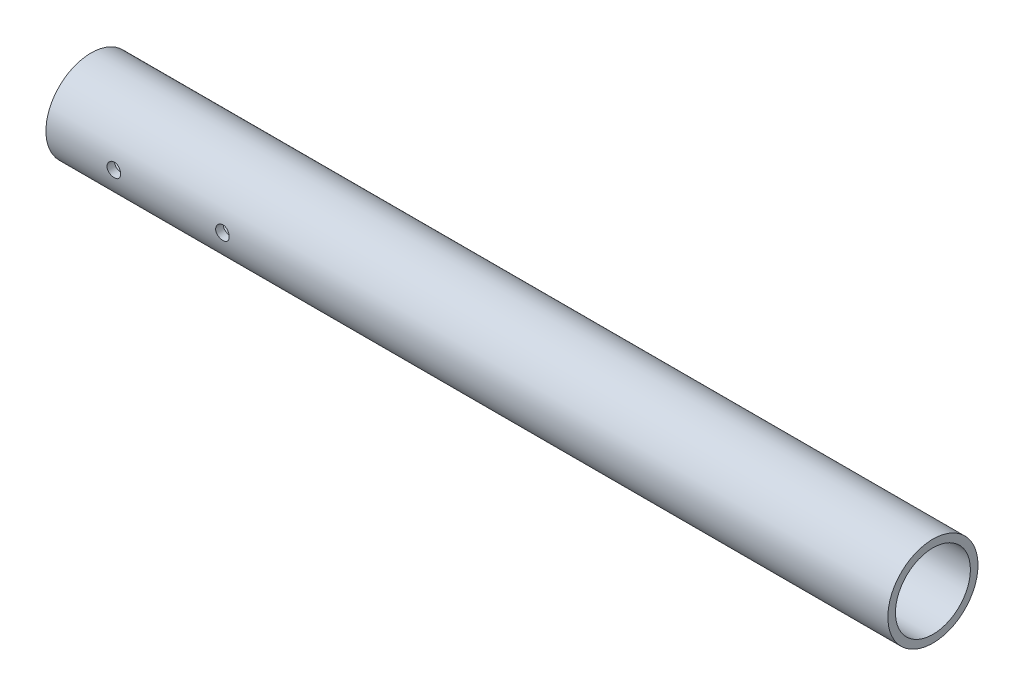
ISO-10303-21;
HEADER;
FILE_DESCRIPTION(('STEP AP214'),'2;1');
FILE_NAME('part.step','',(''),(''),'','','');
FILE_SCHEMA(('AUTOMOTIVE_DESIGN { 1 0 10303 214 1 1 1 1 }'));
ENDSEC;
DATA;
#1=APPLICATION_CONTEXT('core data for automotive mechanical design processes');
#2=APPLICATION_PROTOCOL_DEFINITION('international standard','automotive_design',2000,#1);
#3=PRODUCT_CONTEXT('',#1,'mechanical');
#4=PRODUCT('Part','Part','',(#3));
#5=PRODUCT_RELATED_PRODUCT_CATEGORY('part','',(#4));
#6=PRODUCT_DEFINITION_FORMATION('','',#4);
#7=PRODUCT_DEFINITION_CONTEXT('part definition',#1,'design');
#8=PRODUCT_DEFINITION('design','',#6,#7);
#9=PRODUCT_DEFINITION_SHAPE('','',#8);
#10=(LENGTH_UNIT() NAMED_UNIT(*) SI_UNIT(.MILLI.,.METRE.));
#11=(NAMED_UNIT(*) PLANE_ANGLE_UNIT() SI_UNIT($,.RADIAN.));
#12=(NAMED_UNIT(*) SI_UNIT($,.STERADIAN.) SOLID_ANGLE_UNIT());
#13=UNCERTAINTY_MEASURE_WITH_UNIT(LENGTH_MEASURE(1.E-05),#10,'distance_accuracy_value','');
#14=(GEOMETRIC_REPRESENTATION_CONTEXT(3) GLOBAL_UNCERTAINTY_ASSIGNED_CONTEXT((#13)) GLOBAL_UNIT_ASSIGNED_CONTEXT((#10,
#11,#12)) REPRESENTATION_CONTEXT('',''));
#15=CARTESIAN_POINT('',(0.,0.,0.));
#16=DIRECTION('',(0.,0.,1.));
#17=DIRECTION('',(1.,0.,0.));
#18=AXIS2_PLACEMENT_3D('',#15,#16,#17);
#19=CARTESIAN_POINT('',(-196.85,0.,0.));
#20=DIRECTION('',(1.,0.,0.));
#21=DIRECTION('',(0.,0.,-1.));
#22=AXIS2_PLACEMENT_3D('',#19,#20,#21);
#23=CYLINDRICAL_SURFACE('',#22,21.082);
#24=CARTESIAN_POINT('',(-196.85,0.,0.));
#25=DIRECTION('',(1.,0.,0.));
#26=DIRECTION('',(0.,0.,-1.));
#27=AXIS2_PLACEMENT_3D('',#24,#25,#26);
#28=CIRCLE('',#27,21.082);
#29=CARTESIAN_POINT('',(-196.85,0.,-21.082));
#30=VERTEX_POINT('',#29);
#31=EDGE_CURVE('E10',#30,#30,#28,.T.);
#32=ORIENTED_EDGE('',*,*,#31,.T.);
#33=EDGE_LOOP('',(#32));
#34=FACE_BOUND('',#33,.T.);
#35=CARTESIAN_POINT('',(196.85,0.,0.));
#36=DIRECTION('',(1.,0.,0.));
#37=DIRECTION('',(0.,0.,-1.));
#38=AXIS2_PLACEMENT_3D('',#35,#36,#37);
#39=CIRCLE('',#38,21.082);
#40=CARTESIAN_POINT('',(196.85,0.,-21.082));
#41=VERTEX_POINT('',#40);
#42=EDGE_CURVE('E49',#41,#41,#39,.T.);
#43=ORIENTED_EDGE('',*,*,#42,.F.);
#44=EDGE_LOOP('',(#43));
#45=FACE_BOUND('',#44,.T.);
#46=CARTESIAN_POINT('',(-168.275,0.,21.082));
#47=CARTESIAN_POINT('',(-168.274992696243,0.177265588906064,21.0819971511082));
#48=CARTESIAN_POINT('',(-168.260104327722,0.354633825443566,21.0797407978607));
#49=CARTESIAN_POINT('',(-168.200959639785,0.704412011201187,21.0709569196678));
#50=CARTESIAN_POINT('',(-168.156674780004,0.876816971803984,21.064425243998));
#51=CARTESIAN_POINT('',(-168.040090861165,1.2115560497482,21.0478246855302));
#52=CARTESIAN_POINT('',(-167.967813035828,1.37389769247854,21.0377584843423));
#53=CARTESIAN_POINT('',(-167.797346902468,1.68412370373541,21.0152009969064));
#54=CARTESIAN_POINT('',(-167.69916217104,1.8320100640365,21.0027100454717));
#55=CARTESIAN_POINT('',(-167.478845794194,2.11031643435081,20.9765819826565));
#56=CARTESIAN_POINT('',(-167.3565504399,2.24060616148059,20.9629374218632));
#57=CARTESIAN_POINT('',(-167.091836613573,2.47889671955909,20.9360982303561));
#58=CARTESIAN_POINT('',(-166.949416981135,2.58689626432784,20.9229036256421));
#59=CARTESIAN_POINT('',(-166.647621345587,2.77804840978029,20.8983859912104));
#60=CARTESIAN_POINT('',(-166.488164593206,2.86107486347093,20.8870725883659));
#61=CARTESIAN_POINT('',(-166.157370426842,2.99911783525678,20.8677000439257));
#62=CARTESIAN_POINT('',(-165.986033666236,3.05413589237425,20.8596407235276));
#63=CARTESIAN_POINT('',(-165.637713637157,3.13419550245969,20.8477621012251));
#64=CARTESIAN_POINT('',(-165.460782744137,3.15946016290709,20.8439112577396));
#65=CARTESIAN_POINT('',(-165.105154056933,3.17998699422211,20.8407898425614));
#66=CARTESIAN_POINT('',(-164.926456365603,3.17525090142445,20.8415190057945));
#67=CARTESIAN_POINT('',(-164.573943290049,3.13609297404926,20.8474463775802));
#68=CARTESIAN_POINT('',(-164.40009957517,3.101919701057,20.852607165254));
#69=CARTESIAN_POINT('',(-164.060642024393,3.00524659900985,20.8667578327125));
#70=CARTESIAN_POINT('',(-163.895028423173,2.9427459627244,20.8757478216156));
#71=CARTESIAN_POINT('',(-163.57597641876,2.79093400118089,20.8965852461813));
#72=CARTESIAN_POINT('',(-163.422588837981,2.70151746318002,20.9084438587404));
#73=CARTESIAN_POINT('',(-163.132900855916,2.49848682809598,20.9336742925736));
#74=CARTESIAN_POINT('',(-162.996601585936,2.38487113028626,20.9470462139227));
#75=CARTESIAN_POINT('',(-162.743518756676,2.13530326568608,20.9739618878807));
#76=CARTESIAN_POINT('',(-162.626945855511,1.99913740955179,20.9875060134767));
#77=CARTESIAN_POINT('',(-162.418274544488,1.70906259522473,21.0131148002247));
#78=CARTESIAN_POINT('',(-162.326176243369,1.55515355820367,21.0251794548033));
#79=CARTESIAN_POINT('',(-162.169057340399,1.23377816277263,21.0464826923882));
#80=CARTESIAN_POINT('',(-162.104053073529,1.0663036982249,21.0557195696406));
#81=CARTESIAN_POINT('',(-162.003151041654,0.722645240857121,21.070312259879));
#82=CARTESIAN_POINT('',(-161.967251292923,0.546461842495148,21.0756683373726));
#83=CARTESIAN_POINT('',(-161.925857666781,0.192204765370476,21.0818608911754));
#84=CARTESIAN_POINT('',(-161.920074191204,0.014165649847102,21.0827404122035));
#85=CARTESIAN_POINT('',(-161.938308481612,-0.340339952440584,21.0799979514801));
#86=CARTESIAN_POINT('',(-161.962325317379,-0.516806488119846,21.0763761102388));
#87=CARTESIAN_POINT('',(-162.039237666121,-0.862279899383923,21.0650645063623));
#88=CARTESIAN_POINT('',(-162.091992010307,-1.03131891039135,21.0573946347692));
#89=CARTESIAN_POINT('',(-162.224732948251,-1.35815274399451,21.0388441665934));
#90=CARTESIAN_POINT('',(-162.304720829788,-1.51594703443955,21.0279634181826));
#91=CARTESIAN_POINT('',(-162.490337139215,-1.81708511576191,21.0040933283749));
#92=CARTESIAN_POINT('',(-162.596149173084,-1.9603145348408,20.9910891189132));
#93=CARTESIAN_POINT('',(-162.830154648818,-2.22708618632573,20.9644655933992));
#94=CARTESIAN_POINT('',(-162.958349402479,-2.35062726403488,20.9508462413297));
#95=CARTESIAN_POINT('',(-163.234770906888,-2.57556977848286,20.9243908347895));
#96=CARTESIAN_POINT('',(-163.383156506261,-2.67677703259561,20.9115622997957));
#97=CARTESIAN_POINT('',(-163.694991994603,-2.8528290309045,20.888274456038));
#98=CARTESIAN_POINT('',(-163.858441473836,-2.92767449187153,20.8778150828597));
#99=CARTESIAN_POINT('',(-164.195187201683,-3.04857772519442,20.8605043047131));
#100=CARTESIAN_POINT('',(-164.368446144862,-3.09473749350594,20.8536401303661));
#101=CARTESIAN_POINT('',(-164.720368391081,-3.15728352894343,20.8442630448294));
#102=CARTESIAN_POINT('',(-164.899031316753,-3.17367187018762,20.8417498305174));
#103=CARTESIAN_POINT('',(-165.25475433616,-3.17616021106899,20.8413705974415));
#104=CARTESIAN_POINT('',(-165.431812319645,-3.16256554437416,20.8434577306442));
#105=CARTESIAN_POINT('',(-165.781093207795,-3.10612829026899,20.8519421795031));
#106=CARTESIAN_POINT('',(-165.95331612046,-3.0632857512491,20.8583394880282));
#107=CARTESIAN_POINT('',(-166.287952316415,-2.94967717748468,20.874707044174));
#108=CARTESIAN_POINT('',(-166.450373046203,-2.87893265513936,20.8846745386426));
#109=CARTESIAN_POINT('',(-166.761089428502,-2.71155871536681,20.9070627102117));
#110=CARTESIAN_POINT('',(-166.909384594736,-2.61492840724793,20.9194834717215));
#111=CARTESIAN_POINT('',(-167.189191280687,-2.39741725845486,20.9455292166376));
#112=CARTESIAN_POINT('',(-167.320526091709,-2.27631033164998,20.9591647100844));
#113=CARTESIAN_POINT('',(-167.561117181648,-2.01376149306829,20.9860159394496));
#114=CARTESIAN_POINT('',(-167.670368323069,-1.87231486257536,20.9992315770924));
#115=CARTESIAN_POINT('',(-167.864233030242,-1.57217776718591,21.0238378848768));
#116=CARTESIAN_POINT('',(-167.948706474533,-1.41339594518085,21.0352180180234));
#117=CARTESIAN_POINT('',(-168.089658721969,-1.08380087043068,21.0547677779054));
#118=CARTESIAN_POINT('',(-168.146166480664,-0.913000272113377,21.0629407235248));
#119=CARTESIAN_POINT('',(-168.216783136409,-0.617864332480806,21.0732924950954));
#120=CARTESIAN_POINT('',(-168.238581040015,-0.495349503289414,21.0765410154751));
#121=CARTESIAN_POINT('',(-168.267691941695,-0.248573261637352,21.0808957533839));
#122=CARTESIAN_POINT('',(-168.27500512194,-0.124311871162611,21.0820019978558));
#123=CARTESIAN_POINT('',(-168.275,0.,21.082));
#124=B_SPLINE_CURVE_WITH_KNOTS('',3,(#46,#47,#48,#49,#50,#51,#52,#53,#54,#55,#56,#57,#58,#59,
#60,#61,#62,#63,#64,#65,#66,#67,#68,#69,#70,#71,#72,#73,#74,#75,#76,#77,#78,#79,#80,#81,#82,#83,
#84,#85,#86,#87,#88,#89,#90,#91,#92,#93,#94,#95,#96,#97,#98,#99,#100,#101,#102,#103,#104,#105,
#106,#107,#108,#109,#110,#111,#112,#113,#114,#115,#116,#117,#118,#119,#120,#121,#122,#123),
.UNSPECIFIED.,.T.,.F.,(4,2,2,2,2,2,2,2,2,2,2,2,2,2,2,2,2,2,2,2,2,2,2,2,2,2,2,2,2,2,2,2,2,2,2,2,
2,2,4),(0.,0.53134251242904,1.06320164882559,1.59465813765312,2.12604129424768,2.66116512439553,
3.19631982343619,3.73413403476708,4.27191869076778,4.80564452954643,5.33933947849274,
5.86857170164555,6.39781900700993,6.92916258470443,7.46054132064736,7.99727852314497,
8.53401811031675,9.07108083107701,9.60810694326931,10.1399593459211,10.6717951472021,
11.2010416383702,11.730313159249,12.2634633412738,12.7966447804,13.3342937698578,
13.8719281396386,14.4076397711918,14.9433140793118,15.4735585288678,16.0038021011393,
16.5336376528597,17.0634914377811,17.5984835709691,18.1336000206728,18.6716867332597,
19.2092151415009,19.5818368843675,19.9544539408189),.UNSPECIFIED.);
#125=CARTESIAN_POINT('',(-168.275,0.,21.082));
#126=VERTEX_POINT('',#125);
#127=EDGE_CURVE('E58',#126,#126,#124,.T.);
#128=ORIENTED_EDGE('',*,*,#127,.T.);
#129=EDGE_LOOP('',(#128));
#130=FACE_BOUND('',#129,.T.);
#131=CARTESIAN_POINT('',(-117.475,0.,21.082));
#132=CARTESIAN_POINT('',(-117.474992696243,0.177265588906064,21.0819971511082));
#133=CARTESIAN_POINT('',(-117.460104327722,0.354633825443565,21.0797407978607));
#134=CARTESIAN_POINT('',(-117.400959639785,0.704412011201185,21.0709569196678));
#135=CARTESIAN_POINT('',(-117.356674780004,0.876816971803983,21.064425243998));
#136=CARTESIAN_POINT('',(-117.240090861165,1.21155604974819,21.0478246855302));
#137=CARTESIAN_POINT('',(-117.167813035828,1.37389769247853,21.0377584843423));
#138=CARTESIAN_POINT('',(-116.997346902468,1.68412370373539,21.0152009969064));
#139=CARTESIAN_POINT('',(-116.89916217104,1.83201006403648,21.0027100454717));
#140=CARTESIAN_POINT('',(-116.678845794194,2.1103164343508,20.9765819826565));
#141=CARTESIAN_POINT('',(-116.5565504399,2.24060616148058,20.9629374218632));
#142=CARTESIAN_POINT('',(-116.291836613573,2.47889671955908,20.9360982303561));
#143=CARTESIAN_POINT('',(-116.149416981135,2.58689626432783,20.9229036256421));
#144=CARTESIAN_POINT('',(-115.847621345587,2.77804840978028,20.8983859912104));
#145=CARTESIAN_POINT('',(-115.688164593206,2.86107486347092,20.8870725883659));
#146=CARTESIAN_POINT('',(-115.357370426842,2.99911783525677,20.8677000439257));
#147=CARTESIAN_POINT('',(-115.186033666236,3.05413589237424,20.8596407235276));
#148=CARTESIAN_POINT('',(-114.837713637157,3.13419550245969,20.8477621012251));
#149=CARTESIAN_POINT('',(-114.660782744137,3.15946016290709,20.8439112577396));
#150=CARTESIAN_POINT('',(-114.305154056933,3.17998699422211,20.8407898425614));
#151=CARTESIAN_POINT('',(-114.126456365603,3.17525090142445,20.8415190057945));
#152=CARTESIAN_POINT('',(-113.773943290049,3.13609297404926,20.8474463775802));
#153=CARTESIAN_POINT('',(-113.60009957517,3.101919701057,20.852607165254));
#154=CARTESIAN_POINT('',(-113.260642024393,3.00524659900985,20.8667578327125));
#155=CARTESIAN_POINT('',(-113.095028423174,2.94274596272441,20.8757478216156));
#156=CARTESIAN_POINT('',(-112.77597641876,2.7909340011809,20.8965852461813));
#157=CARTESIAN_POINT('',(-112.622588837981,2.70151746318003,20.9084438587404));
#158=CARTESIAN_POINT('',(-112.332900855916,2.498486828096,20.9336742925736));
#159=CARTESIAN_POINT('',(-112.196601585936,2.38487113028627,20.9470462139227));
#160=CARTESIAN_POINT('',(-111.943518756676,2.1353032656861,20.9739618878806));
#161=CARTESIAN_POINT('',(-111.826945855511,1.99913740955181,20.9875060134767));
#162=CARTESIAN_POINT('',(-111.618274544488,1.70906259522474,21.0131148002247));
#163=CARTESIAN_POINT('',(-111.526176243369,1.55515355820369,21.0251794548033));
#164=CARTESIAN_POINT('',(-111.369057340399,1.23377816277264,21.0464826923882));
#165=CARTESIAN_POINT('',(-111.304053073529,1.06630369822491,21.0557195696406));
#166=CARTESIAN_POINT('',(-111.203151041654,0.722645240857131,21.070312259879));
#167=CARTESIAN_POINT('',(-111.167251292923,0.546461842495156,21.0756683373726));
#168=CARTESIAN_POINT('',(-111.125857666781,0.192204765370483,21.0818608911754));
#169=CARTESIAN_POINT('',(-111.120074191204,0.0141656498471105,21.0827404122035));
#170=CARTESIAN_POINT('',(-111.138308481612,-0.340339952440575,21.0799979514801));
#171=CARTESIAN_POINT('',(-111.162325317379,-0.516806488119837,21.0763761102388));
#172=CARTESIAN_POINT('',(-111.239237666121,-0.86227989938391,21.0650645063623));
#173=CARTESIAN_POINT('',(-111.291992010307,-1.03131891039133,21.0573946347692));
#174=CARTESIAN_POINT('',(-111.424732948251,-1.35815274399449,21.0388441665934));
#175=CARTESIAN_POINT('',(-111.504720829788,-1.51594703443953,21.0279634181826));
#176=CARTESIAN_POINT('',(-111.690337139215,-1.81708511576191,21.0040933283749));
#177=CARTESIAN_POINT('',(-111.796149173084,-1.9603145348408,20.9910891189132));
#178=CARTESIAN_POINT('',(-112.030154648818,-2.22708618632573,20.9644655933992));
#179=CARTESIAN_POINT('',(-112.158349402479,-2.35062726403487,20.9508462413297));
#180=CARTESIAN_POINT('',(-112.434770906888,-2.57556977848285,20.9243908347895));
#181=CARTESIAN_POINT('',(-112.583156506261,-2.67677703259561,20.9115622997957));
#182=CARTESIAN_POINT('',(-112.894991994603,-2.85282903090451,20.888274456038));
#183=CARTESIAN_POINT('',(-113.058441473836,-2.92767449187153,20.8778150828597));
#184=CARTESIAN_POINT('',(-113.395187201683,-3.04857772519442,20.8605043047131));
#185=CARTESIAN_POINT('',(-113.568446144862,-3.09473749350594,20.8536401303661));
#186=CARTESIAN_POINT('',(-113.920368391081,-3.15728352894343,20.8442630448294));
#187=CARTESIAN_POINT('',(-114.099031316753,-3.17367187018762,20.8417498305174));
#188=CARTESIAN_POINT('',(-114.45475433616,-3.17616021106898,20.8413705974415));
#189=CARTESIAN_POINT('',(-114.631812319645,-3.16256554437416,20.8434577306442));
#190=CARTESIAN_POINT('',(-114.981093207795,-3.10612829026899,20.8519421795031));
#191=CARTESIAN_POINT('',(-115.15331612046,-3.0632857512491,20.8583394880282));
#192=CARTESIAN_POINT('',(-115.487952316415,-2.94967717748468,20.874707044174));
#193=CARTESIAN_POINT('',(-115.650373046203,-2.87893265513936,20.8846745386426));
#194=CARTESIAN_POINT('',(-115.961089428502,-2.71155871536682,20.9070627102117));
#195=CARTESIAN_POINT('',(-116.109384594736,-2.61492840724794,20.9194834717215));
#196=CARTESIAN_POINT('',(-116.389191280687,-2.39741725845485,20.9455292166376));
#197=CARTESIAN_POINT('',(-116.520526091709,-2.27631033164997,20.9591647100844));
#198=CARTESIAN_POINT('',(-116.761117181648,-2.01376149306828,20.9860159394496));
#199=CARTESIAN_POINT('',(-116.870368323069,-1.87231486257537,20.9992315770924));
#200=CARTESIAN_POINT('',(-117.064233030242,-1.57217776718592,21.0238378848768));
#201=CARTESIAN_POINT('',(-117.148706474533,-1.41339594518085,21.0352180180234));
#202=CARTESIAN_POINT('',(-117.289658721969,-1.08380087043068,21.0547677779054));
#203=CARTESIAN_POINT('',(-117.346166480664,-0.913000272113387,21.0629407235248));
#204=CARTESIAN_POINT('',(-117.416783136409,-0.617864332480819,21.0732924950954));
#205=CARTESIAN_POINT('',(-117.438581040015,-0.495349503289426,21.0765410154751));
#206=CARTESIAN_POINT('',(-117.467691941695,-0.248573261637358,21.0808957533839));
#207=CARTESIAN_POINT('',(-117.47500512194,-0.124311871162614,21.0820019978558));
#208=CARTESIAN_POINT('',(-117.475,0.,21.082));
#209=B_SPLINE_CURVE_WITH_KNOTS('',3,(#131,#132,#133,#134,#135,#136,#137,#138,#139,#140,#141,
#142,#143,#144,#145,#146,#147,#148,#149,#150,#151,#152,#153,#154,#155,#156,#157,#158,#159,#160,
#161,#162,#163,#164,#165,#166,#167,#168,#169,#170,#171,#172,#173,#174,#175,#176,#177,#178,#179,
#180,#181,#182,#183,#184,#185,#186,#187,#188,#189,#190,#191,#192,#193,#194,#195,#196,#197,#198,
#199,#200,#201,#202,#203,#204,#205,#206,#207,#208),.UNSPECIFIED.,.T.,.F.,(4,2,2,2,2,2,2,2,2,2,2,
2,2,2,2,2,2,2,2,2,2,2,2,2,2,2,2,2,2,2,2,2,2,2,2,2,2,2,4),(0.,0.531342512429038,1.06320164882558,
1.5946581376531,2.12604129424767,2.66116512439551,3.19631982343617,3.73413403476706,
4.27191869076775,4.80564452954642,5.33933947849273,5.86857170164552,6.39781900700991,
6.92916258470442,7.46054132064733,7.99727852314494,8.53401811031673,9.07108083107699,
9.6081069432693,10.1399593459211,10.6717951472021,11.2010416383702,11.730313159249,
12.2634633412738,12.7966447804,13.3342937698578,13.8719281396386,14.4076397711918,
14.9433140793118,15.4735585288678,16.0038021011393,16.5336376528597,17.0634914377811,
17.5984835709691,18.1336000206727,18.6716867332597,19.2092151415009,19.5818368843675,
19.9544539408189),.UNSPECIFIED.);
#210=CARTESIAN_POINT('',(-117.475,0.,21.082));
#211=VERTEX_POINT('',#210);
#212=EDGE_CURVE('E76',#211,#211,#209,.T.);
#213=ORIENTED_EDGE('',*,*,#212,.T.);
#214=EDGE_LOOP('',(#213));
#215=FACE_BOUND('',#214,.T.);
#216=ADVANCED_FACE('F31',(#34,#45,#130,#215),#23,.T.);
#217=CARTESIAN_POINT('',(-196.85,0.,0.));
#218=DIRECTION('',(1.,0.,0.));
#219=DIRECTION('',(0.,0.,-1.));
#220=AXIS2_PLACEMENT_3D('',#217,#218,#219);
#221=CYLINDRICAL_SURFACE('',#220,17.526);
#222=CARTESIAN_POINT('',(-196.85,0.,0.));
#223=DIRECTION('',(1.,0.,0.));
#224=DIRECTION('',(0.,0.,-1.));
#225=AXIS2_PLACEMENT_3D('',#222,#223,#224);
#226=CIRCLE('',#225,17.526);
#227=CARTESIAN_POINT('',(-196.85,0.,-17.526));
#228=VERTEX_POINT('',#227);
#229=EDGE_CURVE('E44',#228,#228,#226,.T.);
#230=ORIENTED_EDGE('',*,*,#229,.F.);
#231=EDGE_LOOP('',(#230));
#232=FACE_BOUND('',#231,.T.);
#233=CARTESIAN_POINT('',(196.85,0.,0.));
#234=DIRECTION('',(1.,0.,0.));
#235=DIRECTION('',(0.,0.,-1.));
#236=AXIS2_PLACEMENT_3D('',#233,#234,#235);
#237=CIRCLE('',#236,17.526);
#238=CARTESIAN_POINT('',(196.85,0.,-17.526));
#239=VERTEX_POINT('',#238);
#240=EDGE_CURVE('E82',#239,#239,#237,.T.);
#241=ORIENTED_EDGE('',*,*,#240,.T.);
#242=EDGE_LOOP('',(#241));
#243=FACE_BOUND('',#242,.T.);
#244=CARTESIAN_POINT('',(-168.275,0.,17.526));
#245=CARTESIAN_POINT('',(-168.274993132514,0.176790823508008,17.5259968412274));
#246=CARTESIAN_POINT('',(-168.26018396573,0.353672270747985,17.5232972774411));
#247=CARTESIAN_POINT('',(-168.201372438004,0.702458155041367,17.5127883009458));
#248=CARTESIAN_POINT('',(-168.157344740396,0.874358137310074,17.5049744534986));
#249=CARTESIAN_POINT('',(-168.041482418544,1.20808580036968,17.485111731742));
#250=CARTESIAN_POINT('',(-167.96967216344,1.3699221643449,17.4730665697294));
#251=CARTESIAN_POINT('',(-167.800350679922,1.67923272236703,17.4460593997375));
#252=CARTESIAN_POINT('',(-167.702841801324,1.82670822784651,17.4310976584752));
#253=CARTESIAN_POINT('',(-167.483729501993,2.10478127681953,17.3997234174553));
#254=CARTESIAN_POINT('',(-167.361893953305,2.23519445696565,17.3832978577657));
#255=CARTESIAN_POINT('',(-167.098086238519,2.47384671567765,17.3509451203049));
#256=CARTESIAN_POINT('',(-166.956112684689,2.58208426483874,17.3350179769725));
#257=CARTESIAN_POINT('',(-166.65476755925,2.77407084888638,17.3053386524232));
#258=CARTESIAN_POINT('',(-166.49527574471,2.8576339824516,17.2916033234658));
#259=CARTESIAN_POINT('',(-166.164227502684,2.9967100266702,17.2680459841376));
#260=CARTESIAN_POINT('',(-165.992672044777,3.05222518866685,17.2582236596927));
#261=CARTESIAN_POINT('',(-165.644333420596,3.13304110203761,17.2437354838221));
#262=CARTESIAN_POINT('',(-165.467626937035,3.15866238598857,17.2390149702052));
#263=CARTESIAN_POINT('',(-165.112365006253,3.17995782064228,17.235099927382));
#264=CARTESIAN_POINT('',(-164.933809714956,3.1756344765814,17.2359049358977));
#265=CARTESIAN_POINT('',(-164.582230051004,3.13742365897766,17.2429001682717));
#266=CARTESIAN_POINT('',(-164.409164708668,3.10389926153133,17.2490242538492));
#267=CARTESIAN_POINT('',(-164.071156214092,3.00880912932248,17.2658638407267));
#268=CARTESIAN_POINT('',(-163.906213386391,2.94724227511611,17.2765795253205));
#269=CARTESIAN_POINT('',(-163.588061936362,2.79745571266685,17.3014647929721));
#270=CARTESIAN_POINT('',(-163.434924507933,2.70908808725447,17.3156534578234));
#271=CARTESIAN_POINT('',(-163.145514150003,2.50831315208049,17.3458731721502));
#272=CARTESIAN_POINT('',(-163.009242823655,2.39590355985283,17.3619043964854));
#273=CARTESIAN_POINT('',(-162.755333896299,2.14827149301382,17.3942918762038));
#274=CARTESIAN_POINT('',(-162.637999429291,2.01273815664841,17.4106494468318));
#275=CARTESIAN_POINT('',(-162.427688621113,1.72374960651158,17.4416297211863));
#276=CARTESIAN_POINT('',(-162.334712494357,1.57029423499867,17.4562524096409));
#277=CARTESIAN_POINT('',(-162.175718396598,1.24951132270804,17.4821419521182));
#278=CARTESIAN_POINT('',(-162.109730448668,1.08216858038396,17.4934050650234));
#279=CARTESIAN_POINT('',(-162.006884348364,0.738524824278301,17.5112771866033));
#280=CARTESIAN_POINT('',(-161.970023310367,0.562224699752729,17.5178866563105));
#281=CARTESIAN_POINT('',(-161.926895827197,0.208280155645559,17.5256438790602));
#282=CARTESIAN_POINT('',(-161.920213792981,0.0306879466818512,17.5268658171028));
#283=CARTESIAN_POINT('',(-161.936521371192,-0.323076767936706,17.5239146703191));
#284=CARTESIAN_POINT('',(-161.959509626478,-0.499249338156011,17.5197418322538));
#285=CARTESIAN_POINT('',(-162.034159642385,-0.843866600411561,17.5065161011469));
#286=CARTESIAN_POINT('',(-162.085612547972,-1.01235801735562,17.4974987676082));
#287=CARTESIAN_POINT('',(-162.215506359517,-1.3383231301214,17.4755909179164));
#288=CARTESIAN_POINT('',(-162.293949001188,-1.49579611656222,17.4627001526692));
#289=CARTESIAN_POINT('',(-162.476525502701,-1.79703794282551,17.4342904171948));
#290=CARTESIAN_POINT('',(-162.580915097512,-1.94064931955918,17.4187457992515));
#291=CARTESIAN_POINT('',(-162.812074418528,-2.20846506883692,17.3868220571775));
#292=CARTESIAN_POINT('',(-162.938846086358,-2.33266775593063,17.3704428607355));
#293=CARTESIAN_POINT('',(-163.213047053409,-2.55970748627499,17.3384518393717));
#294=CARTESIAN_POINT('',(-163.360712095506,-2.66226178053652,17.3228519867864));
#295=CARTESIAN_POINT('',(-163.671417833441,-2.84110984177048,17.2944212278246));
#296=CARTESIAN_POINT('',(-163.834457982026,-2.91740454296297,17.2815902229488));
#297=CARTESIAN_POINT('',(-164.170545034343,-3.04115979533501,17.2602426012819));
#298=CARTESIAN_POINT('',(-164.34354160251,-3.08875345587471,17.2517060985603));
#299=CARTESIAN_POINT('',(-164.695243732187,-3.1541689769781,17.2398671271274));
#300=CARTESIAN_POINT('',(-164.873948695075,-3.17199394891528,17.2365641114227));
#301=CARTESIAN_POINT('',(-165.229165541857,-3.17726742876193,17.2355925385196));
#302=CARTESIAN_POINT('',(-165.405670738435,-3.16516161695717,17.2378413124165));
#303=CARTESIAN_POINT('',(-165.754086632076,-3.11188910689162,17.2475373034534));
#304=CARTESIAN_POINT('',(-165.925997352356,-3.07072255551699,17.2549844943182));
#305=CARTESIAN_POINT('',(-166.260125897203,-2.96067981082376,17.2742044563146));
#306=CARTESIAN_POINT('',(-166.422359022944,-2.8918487670874,17.2859701767276));
#307=CARTESIAN_POINT('',(-166.733046204286,-2.72847862049298,17.3125070165183));
#308=CARTESIAN_POINT('',(-166.88149937582,-2.63393786972799,17.3272783285293));
#309=CARTESIAN_POINT('',(-167.162651300551,-2.42026944589852,17.3584203635157));
#310=CARTESIAN_POINT('',(-167.295100559389,-2.30081626698694,17.37481057328));
#311=CARTESIAN_POINT('',(-167.53822420719,-2.04139533634302,17.4071948659678));
#312=CARTESIAN_POINT('',(-167.648893583025,-1.90142287454243,17.4231888569539));
#313=CARTESIAN_POINT('',(-167.846171023297,-1.60354404533996,17.4531342301883));
#314=CARTESIAN_POINT('',(-167.932571193469,-1.44549813095463,17.4670675069251));
#315=CARTESIAN_POINT('',(-168.077456942508,-1.11693687333545,17.4911451342375));
#316=CARTESIAN_POINT('',(-168.135969245347,-0.946433648982024,17.5012931100993));
#317=CARTESIAN_POINT('',(-168.211276479759,-0.646146664812287,17.5145413811557));
#318=CARTESIAN_POINT('',(-168.235132786512,-0.518138865968793,17.5188145120769));
#319=CARTESIAN_POINT('',(-168.266996893811,-0.260103700609919,17.5245449517082));
#320=CARTESIAN_POINT('',(-168.275005052851,-0.130076379844322,17.5260023241122));
#321=CARTESIAN_POINT('',(-168.275,0.,17.526));
#322=B_SPLINE_CURVE_WITH_KNOTS('',3,(#244,#245,#246,#247,#248,#249,#250,#251,#252,#253,#254,
#255,#256,#257,#258,#259,#260,#261,#262,#263,#264,#265,#266,#267,#268,#269,#270,#271,#272,#273,
#274,#275,#276,#277,#278,#279,#280,#281,#282,#283,#284,#285,#286,#287,#288,#289,#290,#291,#292,
#293,#294,#295,#296,#297,#298,#299,#300,#301,#302,#303,#304,#305,#306,#307,#308,#309,#310,#311,
#312,#313,#314,#315,#316,#317,#318,#319,#320,#321),.UNSPECIFIED.,.T.,.F.,(4,2,2,2,2,2,2,2,2,2,2,
2,2,2,2,2,2,2,2,2,2,2,2,2,2,2,2,2,2,2,2,2,2,2,2,2,2,2,4),(0.,0.52989684739867,1.06025379298762,
1.59014659312776,2.11999095802633,2.65515610450925,3.19035814774706,3.72949522868479,
4.26858902750703,4.80184775131234,5.33506186200683,5.86173930617049,6.3884377769336,
6.91809776769754,7.44780806499452,7.985299753981,8.52279617407827,9.06088891772035,
9.59892834547639,10.1295354893394,10.6601183636946,11.1868588327276,11.713633182854,
12.2458209999473,12.778055006572,13.3168607871052,13.8556473969223,14.3919156166158,
14.9281277829441,15.4564037756751,15.9846770982785,16.5120917356115,17.0395401864443,
17.5743685624972,18.1093198977252,18.648722923454,19.1876080135939,19.5774960261897,
19.9673752191978),.UNSPECIFIED.);
#323=CARTESIAN_POINT('',(-168.275,0.,17.526));
#324=VERTEX_POINT('',#323);
#325=EDGE_CURVE('E52',#324,#324,#322,.T.);
#326=ORIENTED_EDGE('',*,*,#325,.F.);
#327=EDGE_LOOP('',(#326));
#328=FACE_BOUND('',#327,.T.);
#329=CARTESIAN_POINT('',(-117.475,0.,17.526));
#330=CARTESIAN_POINT('',(-117.474993132514,0.176790823508009,17.5259968412274));
#331=CARTESIAN_POINT('',(-117.46018396573,0.353672270747986,17.5232972774411));
#332=CARTESIAN_POINT('',(-117.401372438004,0.702458155041366,17.5127883009458));
#333=CARTESIAN_POINT('',(-117.357344740396,0.874358137310071,17.5049744534986));
#334=CARTESIAN_POINT('',(-117.241482418544,1.20808580036967,17.485111731742));
#335=CARTESIAN_POINT('',(-117.16967216344,1.36992216434489,17.4730665697294));
#336=CARTESIAN_POINT('',(-117.000350679922,1.67923272236702,17.4460593997375));
#337=CARTESIAN_POINT('',(-116.902841801324,1.82670822784651,17.4310976584752));
#338=CARTESIAN_POINT('',(-116.683729501993,2.10478127681952,17.3997234174553));
#339=CARTESIAN_POINT('',(-116.561893953305,2.23519445696564,17.3832978577657));
#340=CARTESIAN_POINT('',(-116.298086238519,2.47384671567764,17.3509451203049));
#341=CARTESIAN_POINT('',(-116.156112684689,2.58208426483874,17.3350179769725));
#342=CARTESIAN_POINT('',(-115.85476755925,2.77407084888638,17.3053386524232));
#343=CARTESIAN_POINT('',(-115.69527574471,2.85763398245159,17.2916033234658));
#344=CARTESIAN_POINT('',(-115.364227502684,2.9967100266702,17.2680459841376));
#345=CARTESIAN_POINT('',(-115.192672044777,3.05222518866685,17.2582236596927));
#346=CARTESIAN_POINT('',(-114.844333420596,3.13304110203761,17.2437354838221));
#347=CARTESIAN_POINT('',(-114.667626937035,3.15866238598856,17.2390149702052));
#348=CARTESIAN_POINT('',(-114.312365006253,3.17995782064228,17.235099927382));
#349=CARTESIAN_POINT('',(-114.133809714956,3.1756344765814,17.2359049358977));
#350=CARTESIAN_POINT('',(-113.782230051004,3.13742365897766,17.2429001682717));
#351=CARTESIAN_POINT('',(-113.609164708668,3.10389926153133,17.2490242538492));
#352=CARTESIAN_POINT('',(-113.271156214092,3.00880912932249,17.2658638407267));
#353=CARTESIAN_POINT('',(-113.106213386391,2.94724227511612,17.2765795253205));
#354=CARTESIAN_POINT('',(-112.788061936362,2.79745571266688,17.3014647929721));
#355=CARTESIAN_POINT('',(-112.634924507933,2.7090880872545,17.3156534578234));
#356=CARTESIAN_POINT('',(-112.345514150003,2.50831315208051,17.3458731721502));
#357=CARTESIAN_POINT('',(-112.209242823655,2.39590355985285,17.3619043964854));
#358=CARTESIAN_POINT('',(-111.955333896299,2.14827149301383,17.3942918762038));
#359=CARTESIAN_POINT('',(-111.837999429291,2.01273815664842,17.4106494468318));
#360=CARTESIAN_POINT('',(-111.627688621113,1.72374960651159,17.4416297211863));
#361=CARTESIAN_POINT('',(-111.534712494357,1.57029423499867,17.4562524096409));
#362=CARTESIAN_POINT('',(-111.375718396598,1.24951132270804,17.4821419521182));
#363=CARTESIAN_POINT('',(-111.309730448668,1.08216858038397,17.4934050650234));
#364=CARTESIAN_POINT('',(-111.206884348364,0.73852482427832,17.5112771866033));
#365=CARTESIAN_POINT('',(-111.170023310367,0.562224699752747,17.5178866563105));
#366=CARTESIAN_POINT('',(-111.126895827197,0.208280155645574,17.5256438790602));
#367=CARTESIAN_POINT('',(-111.120213792981,0.0306879466818639,17.5268658171028));
#368=CARTESIAN_POINT('',(-111.136521371192,-0.323076767936695,17.5239146703191));
#369=CARTESIAN_POINT('',(-111.159509626478,-0.499249338156001,17.5197418322538));
#370=CARTESIAN_POINT('',(-111.234159642385,-0.843866600411554,17.5065161011469));
#371=CARTESIAN_POINT('',(-111.285612547972,-1.01235801735561,17.4974987676082));
#372=CARTESIAN_POINT('',(-111.415506359517,-1.33832313012139,17.4755909179164));
#373=CARTESIAN_POINT('',(-111.493949001188,-1.49579611656221,17.4627001526692));
#374=CARTESIAN_POINT('',(-111.676525502701,-1.7970379428255,17.4342904171948));
#375=CARTESIAN_POINT('',(-111.780915097512,-1.94064931955918,17.4187457992515));
#376=CARTESIAN_POINT('',(-112.012074418528,-2.20846506883692,17.3868220571775));
#377=CARTESIAN_POINT('',(-112.138846086358,-2.33266775593063,17.3704428607355));
#378=CARTESIAN_POINT('',(-112.413047053409,-2.55970748627499,17.3384518393717));
#379=CARTESIAN_POINT('',(-112.560712095506,-2.66226178053652,17.3228519867864));
#380=CARTESIAN_POINT('',(-112.871417833441,-2.84110984177048,17.2944212278246));
#381=CARTESIAN_POINT('',(-113.034457982026,-2.91740454296296,17.2815902229488));
#382=CARTESIAN_POINT('',(-113.370545034343,-3.04115979533501,17.2602426012819));
#383=CARTESIAN_POINT('',(-113.54354160251,-3.08875345587471,17.2517060985603));
#384=CARTESIAN_POINT('',(-113.895243732187,-3.15416897697809,17.2398671271274));
#385=CARTESIAN_POINT('',(-114.073948695075,-3.17199394891527,17.2365641114227));
#386=CARTESIAN_POINT('',(-114.429165541857,-3.17726742876193,17.2355925385196));
#387=CARTESIAN_POINT('',(-114.605670738435,-3.16516161695717,17.2378413124165));
#388=CARTESIAN_POINT('',(-114.954086632076,-3.11188910689162,17.2475373034534));
#389=CARTESIAN_POINT('',(-115.125997352356,-3.07072255551699,17.2549844943182));
#390=CARTESIAN_POINT('',(-115.460125897203,-2.96067981082377,17.2742044563146));
#391=CARTESIAN_POINT('',(-115.622359022944,-2.89184876708741,17.2859701767276));
#392=CARTESIAN_POINT('',(-115.933046204286,-2.72847862049299,17.3125070165183));
#393=CARTESIAN_POINT('',(-116.08149937582,-2.633937869728,17.3272783285292));
#394=CARTESIAN_POINT('',(-116.362651300551,-2.42026944589855,17.3584203635157));
#395=CARTESIAN_POINT('',(-116.495100559389,-2.30081626698697,17.37481057328));
#396=CARTESIAN_POINT('',(-116.73822420719,-2.04139533634304,17.4071948659678));
#397=CARTESIAN_POINT('',(-116.848893583025,-1.90142287454245,17.4231888569539));
#398=CARTESIAN_POINT('',(-117.046171023297,-1.60354404533997,17.4531342301883));
#399=CARTESIAN_POINT('',(-117.132571193469,-1.44549813095465,17.4670675069251));
#400=CARTESIAN_POINT('',(-117.277456942508,-1.11693687333548,17.4911451342375));
#401=CARTESIAN_POINT('',(-117.335969245347,-0.946433648982046,17.5012931100993));
#402=CARTESIAN_POINT('',(-117.411276479759,-0.646146664812306,17.5145413811557));
#403=CARTESIAN_POINT('',(-117.435132786512,-0.518138865968811,17.5188145120769));
#404=CARTESIAN_POINT('',(-117.466996893811,-0.26010370060993,17.5245449517082));
#405=CARTESIAN_POINT('',(-117.475005052851,-0.130076379844328,17.5260023241122));
#406=CARTESIAN_POINT('',(-117.475,0.,17.526));
#407=B_SPLINE_CURVE_WITH_KNOTS('',3,(#329,#330,#331,#332,#333,#334,#335,#336,#337,#338,#339,
#340,#341,#342,#343,#344,#345,#346,#347,#348,#349,#350,#351,#352,#353,#354,#355,#356,#357,#358,
#359,#360,#361,#362,#363,#364,#365,#366,#367,#368,#369,#370,#371,#372,#373,#374,#375,#376,#377,
#378,#379,#380,#381,#382,#383,#384,#385,#386,#387,#388,#389,#390,#391,#392,#393,#394,#395,#396,
#397,#398,#399,#400,#401,#402,#403,#404,#405,#406),.UNSPECIFIED.,.T.,.F.,(4,2,2,2,2,2,2,2,2,2,2,
2,2,2,2,2,2,2,2,2,2,2,2,2,2,2,2,2,2,2,2,2,2,2,2,2,2,2,4),(0.,0.529896847398668,1.06025379298761,
1.59014659312776,2.11999095802632,2.65515610450925,3.19035814774705,3.72949522868479,
4.26858902750701,4.80184775131233,5.33506186200683,5.86173930617045,6.38843777693352,
6.91809776769748,7.4478080649945,7.98529975398098,8.52279617407827,9.06088891772032,
9.59892834547637,10.1295354893394,10.6601183636945,11.1868588327276,11.713633182854,
12.2458209999474,12.778055006572,13.3168607871052,13.8556473969222,14.3919156166157,
14.9281277829441,15.4564037756751,15.9846770982784,16.5120917356115,17.0395401864443,
17.5743685624972,18.1093198977251,18.6487229234539,19.1876080135939,19.5774960261897,
19.9673752191978),.UNSPECIFIED.);
#408=CARTESIAN_POINT('',(-117.475,0.,17.526));
#409=VERTEX_POINT('',#408);
#410=EDGE_CURVE('E35',#409,#409,#407,.T.);
#411=ORIENTED_EDGE('',*,*,#410,.F.);
#412=EDGE_LOOP('',(#411));
#413=FACE_BOUND('',#412,.T.);
#414=ADVANCED_FACE('F59',(#232,#243,#328,#413),#221,.F.);
#415=CARTESIAN_POINT('',(-196.85,0.,0.));
#416=DIRECTION('',(1.,0.,0.));
#417=DIRECTION('',(0.,0.,-1.));
#418=AXIS2_PLACEMENT_3D('',#415,#416,#417);
#419=PLANE('',#418);
#420=ORIENTED_EDGE('',*,*,#229,.T.);
#421=EDGE_LOOP('',(#420));
#422=FACE_BOUND('',#421,.T.);
#423=ORIENTED_EDGE('',*,*,#31,.F.);
#424=EDGE_LOOP('',(#423));
#425=FACE_BOUND('',#424,.T.);
#426=ADVANCED_FACE('F101',(#422,#425),#419,.F.);
#427=CARTESIAN_POINT('',(196.85,0.,0.));
#428=DIRECTION('',(1.,0.,0.));
#429=DIRECTION('',(0.,0.,-1.));
#430=AXIS2_PLACEMENT_3D('',#427,#428,#429);
#431=PLANE('',#430);
#432=ORIENTED_EDGE('',*,*,#42,.T.);
#433=EDGE_LOOP('',(#432));
#434=FACE_BOUND('',#433,.T.);
#435=ORIENTED_EDGE('',*,*,#240,.F.);
#436=EDGE_LOOP('',(#435));
#437=FACE_BOUND('',#436,.T.);
#438=ADVANCED_FACE('F66',(#434,#437),#431,.T.);
#439=CARTESIAN_POINT('',(-165.1,0.,21.082));
#440=DIRECTION('',(0.,0.,-1.));
#441=DIRECTION('',(-1.,0.,0.));
#442=AXIS2_PLACEMENT_3D('',#439,#440,#441);
#443=CYLINDRICAL_SURFACE('',#442,3.17500000000009);
#444=ORIENTED_EDGE('',*,*,#127,.F.);
#445=EDGE_LOOP('',(#444));
#446=FACE_BOUND('',#445,.T.);
#447=ORIENTED_EDGE('',*,*,#325,.T.);
#448=EDGE_LOOP('',(#447));
#449=FACE_BOUND('',#448,.T.);
#450=ADVANCED_FACE('F62',(#446,#449),#443,.F.);
#451=CARTESIAN_POINT('',(-114.3,0.,21.082));
#452=DIRECTION('',(0.,0.,-1.));
#453=DIRECTION('',(-1.,0.,0.));
#454=AXIS2_PLACEMENT_3D('',#451,#452,#453);
#455=CYLINDRICAL_SURFACE('',#454,3.17500000000008);
#456=ORIENTED_EDGE('',*,*,#212,.F.);
#457=EDGE_LOOP('',(#456));
#458=FACE_BOUND('',#457,.T.);
#459=ORIENTED_EDGE('',*,*,#410,.T.);
#460=EDGE_LOOP('',(#459));
#461=FACE_BOUND('',#460,.T.);
#462=ADVANCED_FACE('F65',(#458,#461),#455,.F.);
#463=CLOSED_SHELL('',(#216,#414,#426,#438,#450,#462));
#464=MANIFOLD_SOLID_BREP('B2',#463);
#465=ADVANCED_BREP_SHAPE_REPRESENTATION('',(#18,#464),#14);
#466=SHAPE_DEFINITION_REPRESENTATION(#9,#465);
ENDSEC;
END-ISO-10303-21;
